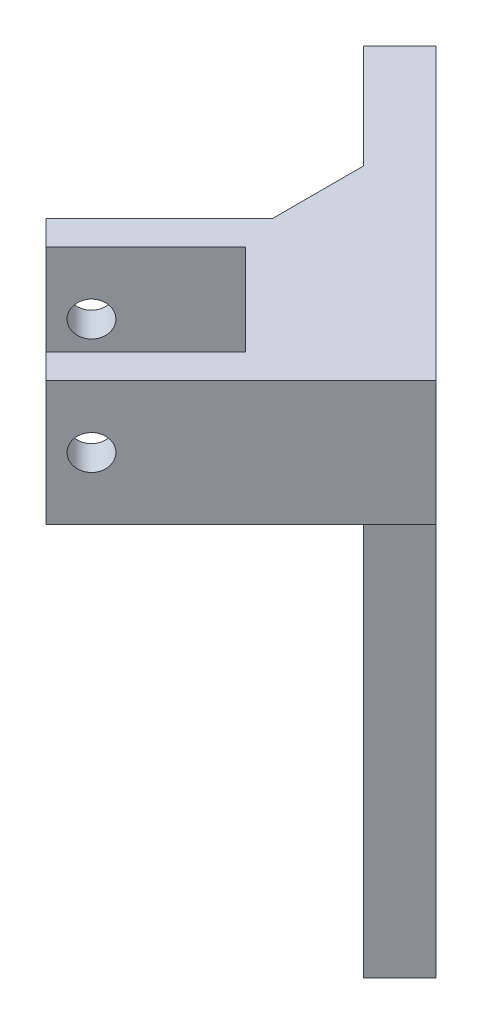
ISO-10303-21;
HEADER;
FILE_DESCRIPTION(('STEP AP214'),'2;1');
FILE_NAME('part.step','',(''),(''),'','','');
FILE_SCHEMA(('AUTOMOTIVE_DESIGN { 1 0 10303 214 1 1 1 1 }'));
ENDSEC;
DATA;
#1=APPLICATION_CONTEXT('core data for automotive mechanical design processes');
#2=APPLICATION_PROTOCOL_DEFINITION('international standard','automotive_design',2000,#1);
#3=PRODUCT_CONTEXT('',#1,'mechanical');
#4=PRODUCT('Part','Part','',(#3));
#5=PRODUCT_RELATED_PRODUCT_CATEGORY('part','',(#4));
#6=PRODUCT_DEFINITION_FORMATION('','',#4);
#7=PRODUCT_DEFINITION_CONTEXT('part definition',#1,'design');
#8=PRODUCT_DEFINITION('design','',#6,#7);
#9=PRODUCT_DEFINITION_SHAPE('','',#8);
#10=(LENGTH_UNIT() NAMED_UNIT(*) SI_UNIT(.MILLI.,.METRE.));
#11=(NAMED_UNIT(*) PLANE_ANGLE_UNIT() SI_UNIT($,.RADIAN.));
#12=(NAMED_UNIT(*) SI_UNIT($,.STERADIAN.) SOLID_ANGLE_UNIT());
#13=UNCERTAINTY_MEASURE_WITH_UNIT(LENGTH_MEASURE(1.E-05),#10,'distance_accuracy_value','');
#14=(GEOMETRIC_REPRESENTATION_CONTEXT(3) GLOBAL_UNCERTAINTY_ASSIGNED_CONTEXT((#13)) GLOBAL_UNIT_ASSIGNED_CONTEXT((#10,
#11,#12)) REPRESENTATION_CONTEXT('',''));
#15=CARTESIAN_POINT('',(0.,0.,0.));
#16=DIRECTION('',(0.,0.,1.));
#17=DIRECTION('',(1.,0.,0.));
#18=AXIS2_PLACEMENT_3D('',#15,#16,#17);
#19=CARTESIAN_POINT('',(5.82842712474632,0.,-5.82842712474632));
#20=DIRECTION('',(0.707106781186547,0.,-0.707106781186547));
#21=DIRECTION('',(-0.707106781186548,0.,-0.707106781186548));
#22=AXIS2_PLACEMENT_3D('',#19,#20,#21);
#23=PLANE('',#22);
#24=DIRECTION('',(0.707106781186547,0.,0.707106781186547));
#25=VECTOR('',#24,1.);
#26=CARTESIAN_POINT('',(10.5578132645612,52.246276120185,-1.09904098493145));
#27=LINE('',#26,#25);
#28=CARTESIAN_POINT('',(28.5960146931866,52.2462761201849,16.9391604436939));
#29=VERTEX_POINT('',#28);
#30=CARTESIAN_POINT('',(32.492080498081,52.2462761201849,20.8352262485884));
#31=VERTEX_POINT('',#30);
#32=EDGE_CURVE('E374',#29,#31,#27,.T.);
#33=ORIENTED_EDGE('',*,*,#32,.F.);
#34=DIRECTION('',(0.,-1.,0.));
#35=VECTOR('',#34,1.);
#36=CARTESIAN_POINT('',(28.5960146931866,0.,16.939160443694));
#37=LINE('',#36,#35);
#38=CARTESIAN_POINT('',(28.5960146931866,32.8244024825225,16.9391604436939));
#39=VERTEX_POINT('',#38);
#40=EDGE_CURVE('E250',#29,#39,#37,.T.);
#41=ORIENTED_EDGE('',*,*,#40,.T.);
#42=DIRECTION('',(-0.707106781186547,0.,-0.707106781186547));
#43=VECTOR('',#42,1.);
#44=CARTESIAN_POINT('',(32.492080498081,32.8244024825225,20.8352262485884));
#45=LINE('',#44,#43);
#46=CARTESIAN_POINT('',(32.492080498081,32.8244024825225,20.8352262485884));
#47=VERTEX_POINT('',#46);
#48=EDGE_CURVE('E489',#47,#39,#45,.T.);
#49=ORIENTED_EDGE('',*,*,#48,.F.);
#50=DIRECTION('',(0.,-1.,0.));
#51=VECTOR('',#50,1.);
#52=CARTESIAN_POINT('',(32.492080498081,52.2462761201849,20.8352262485884));
#53=LINE('',#52,#51);
#54=EDGE_CURVE('E275',#31,#47,#53,.T.);
#55=ORIENTED_EDGE('',*,*,#54,.F.);
#56=EDGE_LOOP('',(#33,#41,#49,#55));
#57=FACE_BOUND('',#56,.T.);
#58=ADVANCED_FACE('F35',(#57),#23,.F.);
#59=CARTESIAN_POINT('',(30.5771644662755,0.,-30.5771644662755));
#60=DIRECTION('',(0.707106781186548,0.,-0.707106781186547));
#61=DIRECTION('',(-0.707106781186547,0.,-0.707106781186548));
#62=AXIS2_PLACEMENT_3D('',#59,#60,#61);
#63=PLANE('',#62);
#64=DIRECTION('',(0.,1.,0.));
#65=VECTOR('',#64,1.);
#66=CARTESIAN_POINT('',(48.0573202068203,32.8244024825225,-13.0970087257306));
#67=LINE('',#66,#65);
#68=CARTESIAN_POINT('',(48.0573202068203,-37.673114458677,-13.0970087257306));
#69=VERTEX_POINT('',#68);
#70=CARTESIAN_POINT('',(48.0573202068203,32.8244024825225,-13.0970087257307));
#71=VERTEX_POINT('',#70);
#72=EDGE_CURVE('E294',#69,#71,#67,.T.);
#73=ORIENTED_EDGE('',*,*,#72,.T.);
#74=DIRECTION('',(-0.707106781186547,0.,-0.707106781186548));
#75=VECTOR('',#74,1.);
#76=CARTESIAN_POINT('',(30.5771644662755,32.8244024825225,-30.5771644662755));
#77=LINE('',#76,#75);
#78=CARTESIAN_POINT('',(39.7606620990654,32.8244024825225,-21.3936668334856));
#79=VERTEX_POINT('',#78);
#80=EDGE_CURVE('E240',#71,#79,#77,.T.);
#81=ORIENTED_EDGE('',*,*,#80,.T.);
#82=DIRECTION('',(0.,-1.,0.));
#83=VECTOR('',#82,1.);
#84=CARTESIAN_POINT('',(39.7606620990653,32.8244024825225,-21.3936668334856));
#85=LINE('',#84,#83);
#86=CARTESIAN_POINT('',(39.7606620990653,-37.673114458677,-21.3936668334856));
#87=VERTEX_POINT('',#86);
#88=EDGE_CURVE('E285',#79,#87,#85,.T.);
#89=ORIENTED_EDGE('',*,*,#88,.T.);
#90=DIRECTION('',(0.707106781186547,0.,0.707106781186548));
#91=VECTOR('',#90,1.);
#92=CARTESIAN_POINT('',(48.0573202068203,-37.673114458677,-13.0970087257306));
#93=LINE('',#92,#91);
#94=EDGE_CURVE('E287',#87,#69,#93,.T.);
#95=ORIENTED_EDGE('',*,*,#94,.T.);
#96=EDGE_LOOP('',(#73,#81,#89,#95));
#97=FACE_BOUND('',#96,.T.);
#98=ADVANCED_FACE('F359',(#97),#63,.F.);
#99=CARTESIAN_POINT('',(48.0573202068203,32.8244024825225,-13.0970087257306));
#100=DIRECTION('',(0.,1.,0.));
#101=DIRECTION('',(0.,0.,1.));
#102=AXIS2_PLACEMENT_3D('',#99,#100,#101);
#103=PLANE('',#102);
#104=DIRECTION('',(0.707106781186548,0.,-0.707106781186547));
#105=VECTOR('',#104,1.);
#106=CARTESIAN_POINT('',(30.5771644662755,32.8244024825225,-30.5771644662755));
#107=LINE('',#106,#105);
#108=CARTESIAN_POINT('',(28.2354827942249,32.8244024825225,-28.2354827942249));
#109=VERTEX_POINT('',#108);
#110=CARTESIAN_POINT('',(36.2340187157679,32.8244024825225,-36.2340187157679));
#111=VERTEX_POINT('',#110);
#112=EDGE_CURVE('E50',#109,#111,#107,.T.);
#113=ORIENTED_EDGE('',*,*,#112,.T.);
#114=DIRECTION('',(0.707106781186548,0.,0.707106781186548));
#115=VECTOR('',#114,1.);
#116=CARTESIAN_POINT('',(53.7141744563127,32.8244024825225,-18.7538629752231));
#117=LINE('',#116,#115);
#118=CARTESIAN_POINT('',(45.4175163485578,32.8244024825225,-27.050521082978));
#119=VERTEX_POINT('',#118);
#120=EDGE_CURVE('E224',#111,#119,#117,.T.);
#121=ORIENTED_EDGE('',*,*,#120,.T.);
#122=DIRECTION('',(0.707106781186548,0.,-0.707106781186547));
#123=VECTOR('',#122,1.);
#124=CARTESIAN_POINT('',(39.7606620990653,32.8244024825225,-21.3936668334856));
#125=LINE('',#124,#123);
#126=EDGE_CURVE('E238',#79,#119,#125,.T.);
#127=ORIENTED_EDGE('',*,*,#126,.F.);
#128=ORIENTED_EDGE('',*,*,#80,.F.);
#129=DIRECTION('',(0.707106781186548,0.,-0.707106781186547));
#130=VECTOR('',#129,1.);
#131=CARTESIAN_POINT('',(48.0573202068203,32.8244024825225,-13.0970087257306));
#132=LINE('',#131,#130);
#133=CARTESIAN_POINT('',(53.7141744563127,32.8244024825225,-18.7538629752231));
#134=VERTEX_POINT('',#133);
#135=EDGE_CURVE('E338',#71,#134,#132,.T.);
#136=ORIENTED_EDGE('',*,*,#135,.T.);
#137=CARTESIAN_POINT('',(62.8976720891026,32.8244024825225,-9.57036534243318));
#138=VERTEX_POINT('',#137);
#139=EDGE_CURVE('E233',#134,#138,#117,.T.);
#140=ORIENTED_EDGE('',*,*,#139,.T.);
#141=DIRECTION('',(0.707106781186548,0.,-0.707106781186547));
#142=VECTOR('',#141,1.);
#143=CARTESIAN_POINT('',(57.2408178396102,32.8244024825225,-3.91351109294075));
#144=LINE('',#143,#142);
#145=EDGE_CURVE('E335',#47,#138,#144,.T.);
#146=ORIENTED_EDGE('',*,*,#145,.F.);
#147=ORIENTED_EDGE('',*,*,#48,.T.);
#148=DIRECTION('',(0.707106781186548,0.,-0.707106781186547));
#149=VECTOR('',#148,1.);
#150=CARTESIAN_POINT('',(53.3447520347157,32.8244024825225,-7.80957689783519));
#151=LINE('',#150,#149);
#152=CARTESIAN_POINT('',(44.1523638792906,32.8244024825225,1.3828112575899));
#153=VERTEX_POINT('',#152);
#154=EDGE_CURVE('E493',#39,#153,#151,.T.);
#155=ORIENTED_EDGE('',*,*,#154,.T.);
#156=DIRECTION('',(-0.707106781186548,0.,-0.707106781186547));
#157=VECTOR('',#156,1.);
#158=CARTESIAN_POINT('',(38.8649320513952,32.8244024825225,-3.90462057030554));
#159=LINE('',#158,#157);
#160=CARTESIAN_POINT('',(30.0102282555597,32.8244024825225,-12.759324366141));
#161=VERTEX_POINT('',#160);
#162=EDGE_CURVE('E490',#153,#161,#159,.T.);
#163=ORIENTED_EDGE('',*,*,#162,.T.);
#164=DIRECTION('',(-0.707106781186547,0.,0.707106781186548));
#165=VECTOR('',#164,1.);
#166=CARTESIAN_POINT('',(39.2026164109848,32.8244024825225,-21.9517125215661));
#167=LINE('',#166,#165);
#168=CARTESIAN_POINT('',(14.4538790694556,32.8244024825225,2.797024819963));
#169=VERTEX_POINT('',#168);
#170=EDGE_CURVE('E504',#161,#169,#167,.T.);
#171=ORIENTED_EDGE('',*,*,#170,.T.);
#172=CARTESIAN_POINT('',(10.5578132645612,32.8244024825225,-1.09904098493145));
#173=VERTEX_POINT('',#172);
#174=EDGE_CURVE('E274',#169,#173,#45,.T.);
#175=ORIENTED_EDGE('',*,*,#174,.T.);
#176=DIRECTION('',(0.707106781186548,0.,-0.707106781186548));
#177=VECTOR('',#176,1.);
#178=CARTESIAN_POINT('',(10.5578132645612,32.8244024825225,-1.09904098493145));
#179=LINE('',#178,#177);
#180=CARTESIAN_POINT('',(28.2354827942249,32.8244024825225,-18.7767105145952));
#181=VERTEX_POINT('',#180);
#182=EDGE_CURVE('E268',#173,#181,#179,.T.);
#183=ORIENTED_EDGE('',*,*,#182,.T.);
#184=DIRECTION('',(0.,0.,-1.));
#185=VECTOR('',#184,1.);
#186=CARTESIAN_POINT('',(28.2354827942249,32.8244024825225,-13.0970087257305));
#187=LINE('',#186,#185);
#188=EDGE_CURVE('E44',#181,#109,#187,.T.);
#189=ORIENTED_EDGE('',*,*,#188,.T.);
#190=EDGE_LOOP('',(#113,#121,#127,#128,#136,#140,#146,#147,#155,#163,#171,#175,#183,#189));
#191=FACE_BOUND('',#190,.T.);
#192=ADVANCED_FACE('F234',(#191),#103,.F.);
#193=CARTESIAN_POINT('',(12.0048651078897,52.2462761201849,-49.1494638246612));
#194=DIRECTION('',(0.,-1.,0.));
#195=DIRECTION('',(0.,0.,-1.));
#196=AXIS2_PLACEMENT_3D('',#193,#194,#195);
#197=PLANE('',#196);
#198=DIRECTION('',(0.707106781186548,0.,-0.707106781186547));
#199=VECTOR('',#198,1.);
#200=CARTESIAN_POINT('',(57.2408178396102,52.2462761201849,-3.91351109294075));
#201=LINE('',#200,#199);
#202=CARTESIAN_POINT('',(62.8976720891026,52.2462761201849,-9.57036534243318));
#203=VERTEX_POINT('',#202);
#204=EDGE_CURVE('E332',#31,#203,#201,.T.);
#205=ORIENTED_EDGE('',*,*,#204,.T.);
#206=DIRECTION('',(-0.707106781186547,0.,-0.707106781186548));
#207=VECTOR('',#206,1.);
#208=CARTESIAN_POINT('',(17.6617193573821,52.2462761201849,-54.8063180741536));
#209=LINE('',#208,#207);
#210=CARTESIAN_POINT('',(17.6617193573821,52.2462761201849,-54.8063180741536));
#211=VERTEX_POINT('',#210);
#212=EDGE_CURVE('E313',#203,#211,#209,.T.);
#213=ORIENTED_EDGE('',*,*,#212,.T.);
#214=DIRECTION('',(0.707106781186548,0.,-0.707106781186547));
#215=VECTOR('',#214,1.);
#216=CARTESIAN_POINT('',(12.0048651078897,52.2462761201849,-49.1494638246612));
#217=LINE('',#216,#215);
#218=CARTESIAN_POINT('',(12.0048651078897,52.2462761201849,-49.1494638246612));
#219=VERTEX_POINT('',#218);
#220=EDGE_CURVE('E329',#219,#211,#217,.T.);
#221=ORIENTED_EDGE('',*,*,#220,.F.);
#222=DIRECTION('',(-0.707106781186547,0.,-0.707106781186548));
#223=VECTOR('',#222,1.);
#224=CARTESIAN_POINT('',(12.0048651078897,52.2462761201849,-49.1494638246612));
#225=LINE('',#224,#223);
#226=CARTESIAN_POINT('',(28.2354827942248,52.2462761201849,-32.9188461383261));
#227=VERTEX_POINT('',#226);
#228=EDGE_CURVE('E297',#227,#219,#225,.T.);
#229=ORIENTED_EDGE('',*,*,#228,.F.);
#230=DIRECTION('',(0.,0.,1.));
#231=VECTOR('',#230,1.);
#232=CARTESIAN_POINT('',(28.2354827942248,52.2462761201849,-49.1494638246613));
#233=LINE('',#232,#231);
#234=CARTESIAN_POINT('',(28.2354827942249,52.246276120185,-18.7767105145952));
#235=VERTEX_POINT('',#234);
#236=EDGE_CURVE('E58',#227,#235,#233,.T.);
#237=ORIENTED_EDGE('',*,*,#236,.T.);
#238=DIRECTION('',(0.707106781186548,0.,-0.707106781186548));
#239=VECTOR('',#238,1.);
#240=CARTESIAN_POINT('',(10.5578132645612,52.246276120185,-1.09904098493145));
#241=LINE('',#240,#239);
#242=CARTESIAN_POINT('',(10.5578132645612,52.246276120185,-1.09904098493145));
#243=VERTEX_POINT('',#242);
#244=EDGE_CURVE('E270',#243,#235,#241,.T.);
#245=ORIENTED_EDGE('',*,*,#244,.F.);
#246=CARTESIAN_POINT('',(14.4538790694556,52.246276120185,2.79702481996299));
#247=VERTEX_POINT('',#246);
#248=EDGE_CURVE('E371',#243,#247,#27,.T.);
#249=ORIENTED_EDGE('',*,*,#248,.T.);
#250=DIRECTION('',(-0.707106781186547,0.,0.707106781186548));
#251=VECTOR('',#250,1.);
#252=CARTESIAN_POINT('',(30.0102282555597,52.2462761201849,-12.7593243661411));
#253=LINE('',#252,#251);
#254=CARTESIAN_POINT('',(30.0102282555597,52.2462761201849,-12.7593243661411));
#255=VERTEX_POINT('',#254);
#256=EDGE_CURVE('E510',#255,#247,#253,.T.);
#257=ORIENTED_EDGE('',*,*,#256,.F.);
#258=DIRECTION('',(-0.707106781186548,0.,-0.707106781186547));
#259=VECTOR('',#258,1.);
#260=CARTESIAN_POINT('',(44.1523638792906,52.2462761201849,1.3828112575899));
#261=LINE('',#260,#259);
#262=CARTESIAN_POINT('',(44.1523638792906,52.2462761201849,1.3828112575899));
#263=VERTEX_POINT('',#262);
#264=EDGE_CURVE('E513',#263,#255,#261,.T.);
#265=ORIENTED_EDGE('',*,*,#264,.F.);
#266=DIRECTION('',(0.707106781186548,0.,-0.707106781186547));
#267=VECTOR('',#266,1.);
#268=CARTESIAN_POINT('',(28.5960146931866,52.2462761201849,16.9391604436939));
#269=LINE('',#268,#267);
#270=EDGE_CURVE('E500',#29,#263,#269,.T.);
#271=ORIENTED_EDGE('',*,*,#270,.F.);
#272=ORIENTED_EDGE('',*,*,#32,.T.);
#273=EDGE_LOOP('',(#205,#213,#221,#229,#237,#245,#249,#257,#265,#271,#272));
#274=FACE_BOUND('',#273,.T.);
#275=ADVANCED_FACE('F497',(#274),#197,.F.);
#276=CARTESIAN_POINT('',(36.2340187157679,0.,-36.2340187157678));
#277=DIRECTION('',(0.707106781186548,0.,-0.707106781186547));
#278=DIRECTION('',(-0.707106781186547,0.,-0.707106781186548));
#279=AXIS2_PLACEMENT_3D('',#276,#277,#278);
#280=PLANE('',#279);
#281=DIRECTION('',(0.,-1.,0.));
#282=VECTOR('',#281,1.);
#283=CARTESIAN_POINT('',(12.4374394279131,0.,-60.0305980036226));
#284=LINE('',#283,#282);
#285=CARTESIAN_POINT('',(12.4374394279131,32.069709817124,-60.0305980036226));
#286=VERTEX_POINT('',#285);
#287=CARTESIAN_POINT('',(12.4374394279131,-47.930290182876,-60.0305980036226));
#288=VERTEX_POINT('',#287);
#289=EDGE_CURVE('E421',#286,#288,#284,.T.);
#290=ORIENTED_EDGE('',*,*,#289,.T.);
#291=CARTESIAN_POINT('',(13.7455869731083,-47.930290182876,-58.7224504584275));
#292=DIRECTION('',(0.707106781186548,0.,-0.707106781186547));
#293=DIRECTION('',(-0.707106781186547,0.,-0.707106781186548));
#294=AXIS2_PLACEMENT_3D('',#291,#292,#293);
#295=CIRCLE('',#294,1.85000000000001);
#296=CARTESIAN_POINT('',(15.0537345183034,-47.930290182876,-57.4143029132324));
#297=VERTEX_POINT('',#296);
#298=EDGE_CURVE('E423',#297,#288,#295,.T.);
#299=ORIENTED_EDGE('',*,*,#298,.F.);
#300=DIRECTION('',(0.,-1.,0.));
#301=VECTOR('',#300,1.);
#302=CARTESIAN_POINT('',(15.0537345183034,0.,-57.4143029132324));
#303=LINE('',#302,#301);
#304=CARTESIAN_POINT('',(15.0537345183033,32.069709817124,-57.4143029132324));
#305=VERTEX_POINT('',#304);
#306=EDGE_CURVE('E426',#305,#297,#303,.T.);
#307=ORIENTED_EDGE('',*,*,#306,.F.);
#308=CARTESIAN_POINT('',(13.7455869731083,32.069709817124,-58.7224504584275));
#309=DIRECTION('',(0.707106781186548,0.,-0.707106781186547));
#310=DIRECTION('',(-0.707106781186547,0.,-0.707106781186548));
#311=AXIS2_PLACEMENT_3D('',#308,#309,#310);
#312=CIRCLE('',#311,1.85);
#313=EDGE_CURVE('E413',#286,#305,#312,.T.);
#314=ORIENTED_EDGE('',*,*,#313,.F.);
#315=EDGE_LOOP('',(#290,#299,#307,#314));
#316=FACE_BOUND('',#315,.T.);
#317=DIRECTION('',(0.,-1.,0.));
#318=VECTOR('',#317,1.);
#319=CARTESIAN_POINT('',(22.1248023301688,0.,-50.3432351013669));
#320=LINE('',#319,#318);
#321=CARTESIAN_POINT('',(22.1248023301688,32.069709817124,-50.3432351013669));
#322=VERTEX_POINT('',#321);
#323=CARTESIAN_POINT('',(22.1248023301688,-47.930290182876,-50.3432351013669));
#324=VERTEX_POINT('',#323);
#325=EDGE_CURVE('E433',#322,#324,#320,.T.);
#326=ORIENTED_EDGE('',*,*,#325,.T.);
#327=CARTESIAN_POINT('',(23.4329498753639,-47.930290182876,-49.0350875561718));
#328=DIRECTION('',(0.707106781186548,0.,-0.707106781186547));
#329=DIRECTION('',(-0.707106781186547,0.,-0.707106781186548));
#330=AXIS2_PLACEMENT_3D('',#327,#328,#329);
#331=CIRCLE('',#330,1.85000000000001);
#332=CARTESIAN_POINT('',(24.7410974205591,-47.930290182876,-47.7269400109767));
#333=VERTEX_POINT('',#332);
#334=EDGE_CURVE('E306',#333,#324,#331,.T.);
#335=ORIENTED_EDGE('',*,*,#334,.F.);
#336=DIRECTION('',(0.,-1.,0.));
#337=VECTOR('',#336,1.);
#338=CARTESIAN_POINT('',(24.7410974205591,0.,-47.7269400109767));
#339=LINE('',#338,#337);
#340=CARTESIAN_POINT('',(24.7410974205591,32.069709817124,-47.7269400109767));
#341=VERTEX_POINT('',#340);
#342=EDGE_CURVE('E428',#341,#333,#339,.T.);
#343=ORIENTED_EDGE('',*,*,#342,.F.);
#344=CARTESIAN_POINT('',(23.4329498753639,32.069709817124,-49.0350875561718));
#345=DIRECTION('',(0.707106781186548,0.,-0.707106781186547));
#346=DIRECTION('',(-0.707106781186547,0.,-0.707106781186548));
#347=AXIS2_PLACEMENT_3D('',#344,#345,#346);
#348=CIRCLE('',#347,1.84999999999999);
#349=EDGE_CURVE('E430',#322,#341,#348,.T.);
#350=ORIENTED_EDGE('',*,*,#349,.F.);
#351=EDGE_LOOP('',(#326,#335,#343,#350));
#352=FACE_BOUND('',#351,.T.);
#353=DIRECTION('',(0.707106781186547,0.,0.707106781186547));
#354=VECTOR('',#353,1.);
#355=CARTESIAN_POINT('',(7.5309128756247,-53.2202506721997,-64.937124555911));
#356=LINE('',#355,#354);
#357=CARTESIAN_POINT('',(7.5309128756247,-53.2202506721997,-64.937124555911));
#358=VERTEX_POINT('',#357);
#359=CARTESIAN_POINT('',(29.6476239728475,-53.2202506721997,-42.8204134586882));
#360=VERTEX_POINT('',#359);
#361=EDGE_CURVE('E289',#358,#360,#356,.T.);
#362=ORIENTED_EDGE('',*,*,#361,.F.);
#363=DIRECTION('',(0.,-1.,0.));
#364=VECTOR('',#363,1.);
#365=CARTESIAN_POINT('',(7.5309128756247,32.8244024825225,-64.937124555911));
#366=LINE('',#365,#364);
#367=CARTESIAN_POINT('',(7.5309128756247,37.9191521959063,-64.937124555911));
#368=VERTEX_POINT('',#367);
#369=EDGE_CURVE('E318',#368,#358,#366,.T.);
#370=ORIENTED_EDGE('',*,*,#369,.F.);
#371=DIRECTION('',(-0.500000000000001,-0.707106781186546,-0.500000000000001));
#372=VECTOR('',#371,1.);
#373=CARTESIAN_POINT('',(7.5309128756247,37.9191521959063,-64.937124555911));
#374=LINE('',#373,#372);
#375=EDGE_CURVE('E315',#211,#368,#374,.T.);
#376=ORIENTED_EDGE('',*,*,#375,.F.);
#377=ORIENTED_EDGE('',*,*,#212,.F.);
#378=DIRECTION('',(0.,1.,0.));
#379=VECTOR('',#378,1.);
#380=CARTESIAN_POINT('',(62.8976720891026,52.2462761201849,-9.57036534243318));
#381=LINE('',#380,#379);
#382=EDGE_CURVE('E231',#138,#203,#381,.T.);
#383=ORIENTED_EDGE('',*,*,#382,.F.);
#384=ORIENTED_EDGE('',*,*,#139,.F.);
#385=DIRECTION('',(0.,1.,0.));
#386=VECTOR('',#385,1.);
#387=CARTESIAN_POINT('',(53.7141744563127,32.8244024825225,-18.753862975223));
#388=LINE('',#387,#386);
#389=CARTESIAN_POINT('',(53.7141744563127,-37.673114458677,-18.753862975223));
#390=VERTEX_POINT('',#389);
#391=EDGE_CURVE('E311',#390,#134,#388,.T.);
#392=ORIENTED_EDGE('',*,*,#391,.F.);
#393=DIRECTION('',(0.707106781186547,0.,0.707106781186548));
#394=VECTOR('',#393,1.);
#395=CARTESIAN_POINT('',(53.7141744563127,-37.673114458677,-18.753862975223));
#396=LINE('',#395,#394);
#397=CARTESIAN_POINT('',(45.4175163485577,-37.673114458677,-27.050521082978));
#398=VERTEX_POINT('',#397);
#399=EDGE_CURVE('E309',#398,#390,#396,.T.);
#400=ORIENTED_EDGE('',*,*,#399,.F.);
#401=DIRECTION('',(0.,-1.,0.));
#402=VECTOR('',#401,1.);
#403=CARTESIAN_POINT('',(45.4175163485577,32.8244024825225,-27.050521082978));
#404=LINE('',#403,#402);
#405=EDGE_CURVE('E220',#119,#398,#404,.T.);
#406=ORIENTED_EDGE('',*,*,#405,.F.);
#407=ORIENTED_EDGE('',*,*,#120,.F.);
#408=DIRECTION('',(0.500000000000001,0.707106781186546,0.500000000000001));
#409=VECTOR('',#408,1.);
#410=CARTESIAN_POINT('',(29.6476239728475,23.5098337099417,-42.8204134586882));
#411=LINE('',#410,#409);
#412=CARTESIAN_POINT('',(29.6476239728475,23.5098337099417,-42.8204134586882));
#413=VERTEX_POINT('',#412);
#414=EDGE_CURVE('E213',#413,#111,#411,.T.);
#415=ORIENTED_EDGE('',*,*,#414,.F.);
#416=DIRECTION('',(0.,1.,0.));
#417=VECTOR('',#416,1.);
#418=CARTESIAN_POINT('',(29.6476239728475,-53.2202506721997,-42.8204134586882));
#419=LINE('',#418,#417);
#420=EDGE_CURVE('E221',#360,#413,#419,.T.);
#421=ORIENTED_EDGE('',*,*,#420,.F.);
#422=EDGE_LOOP('',(#362,#370,#376,#377,#383,#384,#392,#400,#406,#407,#415,#421));
#423=FACE_BOUND('',#422,.T.);
#424=ADVANCED_FACE('F226',(#316,#352,#423),#280,.T.);
#425=CARTESIAN_POINT('',(23.9907697233551,-53.2202506721997,-37.1635592091958));
#426=DIRECTION('',(-0.707106781186547,0.,-0.707106781186548));
#427=DIRECTION('',(-0.707106781186548,0.,0.707106781186547));
#428=AXIS2_PLACEMENT_3D('',#425,#426,#427);
#429=PLANE('',#428);
#430=ORIENTED_EDGE('',*,*,#420,.T.);
#431=DIRECTION('',(0.707106781186548,0.,-0.707106781186547));
#432=VECTOR('',#431,1.);
#433=CARTESIAN_POINT('',(23.9907697233551,23.5098337099417,-37.1635592091958));
#434=LINE('',#433,#432);
#435=CARTESIAN_POINT('',(23.9907697233551,23.5098337099417,-37.1635592091958));
#436=VERTEX_POINT('',#435);
#437=EDGE_CURVE('E217',#436,#413,#434,.T.);
#438=ORIENTED_EDGE('',*,*,#437,.F.);
#439=DIRECTION('',(0.,1.,0.));
#440=VECTOR('',#439,1.);
#441=CARTESIAN_POINT('',(23.9907697233551,-53.2202506721997,-37.1635592091958));
#442=LINE('',#441,#440);
#443=CARTESIAN_POINT('',(23.9907697233551,-53.2202506721997,-37.1635592091958));
#444=VERTEX_POINT('',#443);
#445=EDGE_CURVE('E284',#444,#436,#442,.T.);
#446=ORIENTED_EDGE('',*,*,#445,.F.);
#447=DIRECTION('',(0.707106781186548,0.,-0.707106781186547));
#448=VECTOR('',#447,1.);
#449=CARTESIAN_POINT('',(23.9907697233551,-53.2202506721997,-37.1635592091958));
#450=LINE('',#449,#448);
#451=EDGE_CURVE('E305',#444,#360,#450,.T.);
#452=ORIENTED_EDGE('',*,*,#451,.T.);
#453=EDGE_LOOP('',(#430,#438,#446,#452));
#454=FACE_BOUND('',#453,.T.);
#455=ADVANCED_FACE('F572',(#454),#429,.F.);
#456=CARTESIAN_POINT('',(23.9907697233551,23.5098337099417,-37.1635592091958));
#457=DIRECTION('',(-0.499999999999999,0.707106781186549,-0.499999999999999));
#458=DIRECTION('',(0.,0.577350269189624,0.816496580927727));
#459=AXIS2_PLACEMENT_3D('',#456,#457,#458);
#460=PLANE('',#459);
#461=ORIENTED_EDGE('',*,*,#414,.T.);
#462=ORIENTED_EDGE('',*,*,#112,.F.);
#463=DIRECTION('',(0.,-0.577350269189626,-0.816496580927726));
#464=VECTOR('',#463,1.);
#465=CARTESIAN_POINT('',(28.2354827942248,25.5108106410104,-38.5784635661524));
#466=LINE('',#465,#464);
#467=CARTESIAN_POINT('',(28.2354827942248,29.512764503148,-32.9188461383261));
#468=VERTEX_POINT('',#467);
#469=EDGE_CURVE('E11',#109,#468,#466,.T.);
#470=ORIENTED_EDGE('',*,*,#469,.T.);
#471=DIRECTION('',(0.500000000000001,0.707106781186546,0.500000000000001));
#472=VECTOR('',#471,1.);
#473=CARTESIAN_POINT('',(23.9907697233551,23.5098337099417,-37.1635592091958));
#474=LINE('',#473,#472);
#475=EDGE_CURVE('E279',#436,#468,#474,.T.);
#476=ORIENTED_EDGE('',*,*,#475,.F.);
#477=ORIENTED_EDGE('',*,*,#437,.T.);
#478=EDGE_LOOP('',(#461,#462,#470,#476,#477));
#479=FACE_BOUND('',#478,.T.);
#480=ADVANCED_FACE('F215',(#479),#460,.F.);
#481=CARTESIAN_POINT('',(39.7606620990653,32.8244024825225,-21.3936668334856));
#482=DIRECTION('',(0.707106781186547,0.,0.707106781186548));
#483=DIRECTION('',(0.707106781186548,0.,-0.707106781186547));
#484=AXIS2_PLACEMENT_3D('',#481,#482,#483);
#485=PLANE('',#484);
#486=ORIENTED_EDGE('',*,*,#405,.T.);
#487=DIRECTION('',(0.707106781186548,0.,-0.707106781186547));
#488=VECTOR('',#487,1.);
#489=CARTESIAN_POINT('',(39.7606620990653,-37.673114458677,-21.3936668334856));
#490=LINE('',#489,#488);
#491=EDGE_CURVE('E242',#87,#398,#490,.T.);
#492=ORIENTED_EDGE('',*,*,#491,.F.);
#493=ORIENTED_EDGE('',*,*,#88,.F.);
#494=ORIENTED_EDGE('',*,*,#126,.T.);
#495=EDGE_LOOP('',(#486,#492,#493,#494));
#496=FACE_BOUND('',#495,.T.);
#497=ADVANCED_FACE('F360',(#496),#485,.F.);
#498=CARTESIAN_POINT('',(48.0573202068203,-37.673114458677,-13.0970087257306));
#499=DIRECTION('',(0.,1.,0.));
#500=DIRECTION('',(0.,0.,1.));
#501=AXIS2_PLACEMENT_3D('',#498,#499,#500);
#502=PLANE('',#501);
#503=ORIENTED_EDGE('',*,*,#399,.T.);
#504=DIRECTION('',(0.707106781186548,0.,-0.707106781186547));
#505=VECTOR('',#504,1.);
#506=CARTESIAN_POINT('',(48.0573202068203,-37.673114458677,-13.0970087257306));
#507=LINE('',#506,#505);
#508=EDGE_CURVE('E341',#69,#390,#507,.T.);
#509=ORIENTED_EDGE('',*,*,#508,.F.);
#510=ORIENTED_EDGE('',*,*,#94,.F.);
#511=ORIENTED_EDGE('',*,*,#491,.T.);
#512=EDGE_LOOP('',(#503,#509,#510,#511));
#513=FACE_BOUND('',#512,.T.);
#514=ADVANCED_FACE('F347',(#513),#502,.F.);
#515=CARTESIAN_POINT('',(48.0573202068203,32.8244024825225,-13.0970087257306));
#516=DIRECTION('',(-0.707106781186547,0.,-0.707106781186548));
#517=DIRECTION('',(-0.707106781186548,0.,0.707106781186547));
#518=AXIS2_PLACEMENT_3D('',#515,#516,#517);
#519=PLANE('',#518);
#520=ORIENTED_EDGE('',*,*,#391,.T.);
#521=ORIENTED_EDGE('',*,*,#135,.F.);
#522=ORIENTED_EDGE('',*,*,#72,.F.);
#523=ORIENTED_EDGE('',*,*,#508,.T.);
#524=EDGE_LOOP('',(#520,#521,#522,#523));
#525=FACE_BOUND('',#524,.T.);
#526=ADVANCED_FACE('F356',(#525),#519,.F.);
#527=CARTESIAN_POINT('',(57.2408178396102,52.2462761201849,-3.91351109294075));
#528=DIRECTION('',(-0.707106781186547,0.,-0.707106781186548));
#529=DIRECTION('',(-0.707106781186548,0.,0.707106781186547));
#530=AXIS2_PLACEMENT_3D('',#527,#528,#529);
#531=PLANE('',#530);
#532=CARTESIAN_POINT('',(36.0276144040138,42.5353393013537,17.2996923426556));
#533=DIRECTION('',(-0.707106781186547,0.,-0.707106781186548));
#534=DIRECTION('',(-0.707106781186548,0.,0.707106781186547));
#535=AXIS2_PLACEMENT_3D('',#532,#533,#534);
#536=CIRCLE('',#535,2.7);
#537=CARTESIAN_POINT('',(34.1184260948101,42.5353393013537,19.2088806518593));
#538=VERTEX_POINT('',#537);
#539=EDGE_CURVE('E517',#538,#538,#536,.T.);
#540=ORIENTED_EDGE('',*,*,#539,.T.);
#541=EDGE_LOOP('',(#540));
#542=FACE_BOUND('',#541,.T.);
#543=ORIENTED_EDGE('',*,*,#145,.T.);
#544=ORIENTED_EDGE('',*,*,#382,.T.);
#545=ORIENTED_EDGE('',*,*,#204,.F.);
#546=ORIENTED_EDGE('',*,*,#54,.T.);
#547=EDGE_LOOP('',(#543,#544,#545,#546));
#548=FACE_BOUND('',#547,.T.);
#549=ADVANCED_FACE('F366',(#542,#548),#531,.F.);
#550=CARTESIAN_POINT('',(1.87405862613232,37.9191521959063,-59.2802703064186));
#551=DIRECTION('',(0.499999999999999,-0.707106781186549,0.499999999999999));
#552=DIRECTION('',(0.,-0.577350269189625,-0.816496580927727));
#553=AXIS2_PLACEMENT_3D('',#550,#551,#552);
#554=PLANE('',#553);
#555=ORIENTED_EDGE('',*,*,#375,.T.);
#556=DIRECTION('',(0.707106781186548,0.,-0.707106781186547));
#557=VECTOR('',#556,1.);
#558=CARTESIAN_POINT('',(1.87405862613232,37.9191521959063,-59.2802703064186));
#559=LINE('',#558,#557);
#560=CARTESIAN_POINT('',(1.87405862613232,37.9191521959063,-59.2802703064186));
#561=VERTEX_POINT('',#560);
#562=EDGE_CURVE('E326',#561,#368,#559,.T.);
#563=ORIENTED_EDGE('',*,*,#562,.F.);
#564=DIRECTION('',(-0.500000000000001,-0.707106781186546,-0.500000000000001));
#565=VECTOR('',#564,1.);
#566=CARTESIAN_POINT('',(1.87405862613232,37.9191521959063,-59.2802703064186));
#567=LINE('',#566,#565);
#568=EDGE_CURVE('E299',#219,#561,#567,.T.);
#569=ORIENTED_EDGE('',*,*,#568,.F.);
#570=ORIENTED_EDGE('',*,*,#220,.T.);
#571=EDGE_LOOP('',(#555,#563,#569,#570));
#572=FACE_BOUND('',#571,.T.);
#573=ADVANCED_FACE('F553',(#572),#554,.F.);
#574=CARTESIAN_POINT('',(1.87405862613232,32.8244024825225,-59.2802703064186));
#575=DIRECTION('',(0.707106781186547,0.,0.707106781186548));
#576=DIRECTION('',(0.707106781186548,0.,-0.707106781186547));
#577=AXIS2_PLACEMENT_3D('',#574,#575,#576);
#578=PLANE('',#577);
#579=ORIENTED_EDGE('',*,*,#369,.T.);
#580=DIRECTION('',(0.707106781186548,0.,-0.707106781186547));
#581=VECTOR('',#580,1.);
#582=CARTESIAN_POINT('',(1.87405862613232,-53.2202506721997,-59.2802703064186));
#583=LINE('',#582,#581);
#584=CARTESIAN_POINT('',(1.87405862613232,-53.2202506721997,-59.2802703064186));
#585=VERTEX_POINT('',#584);
#586=EDGE_CURVE('E323',#585,#358,#583,.T.);
#587=ORIENTED_EDGE('',*,*,#586,.F.);
#588=DIRECTION('',(0.,-1.,0.));
#589=VECTOR('',#588,1.);
#590=CARTESIAN_POINT('',(1.87405862613232,32.8244024825225,-59.2802703064186));
#591=LINE('',#590,#589);
#592=EDGE_CURVE('E301',#561,#585,#591,.T.);
#593=ORIENTED_EDGE('',*,*,#592,.F.);
#594=ORIENTED_EDGE('',*,*,#562,.T.);
#595=EDGE_LOOP('',(#579,#587,#593,#594));
#596=FACE_BOUND('',#595,.T.);
#597=ADVANCED_FACE('F559',(#596),#578,.F.);
#598=CARTESIAN_POINT('',(1.87405862613232,-53.2202506721997,-59.2802703064186));
#599=DIRECTION('',(0.,1.,0.));
#600=DIRECTION('',(0.,0.,1.));
#601=AXIS2_PLACEMENT_3D('',#598,#599,#600);
#602=PLANE('',#601);
#603=ORIENTED_EDGE('',*,*,#361,.T.);
#604=ORIENTED_EDGE('',*,*,#451,.F.);
#605=DIRECTION('',(0.707106781186547,0.,0.707106781186547));
#606=VECTOR('',#605,1.);
#607=CARTESIAN_POINT('',(1.87405862613232,-53.2202506721997,-59.2802703064186));
#608=LINE('',#607,#606);
#609=EDGE_CURVE('E303',#585,#444,#608,.T.);
#610=ORIENTED_EDGE('',*,*,#609,.F.);
#611=ORIENTED_EDGE('',*,*,#586,.T.);
#612=EDGE_LOOP('',(#603,#604,#610,#611));
#613=FACE_BOUND('',#612,.T.);
#614=ADVANCED_FACE('F584',(#613),#602,.F.);
#615=DIRECTION('',(0.,1.,0.));
#616=VECTOR('',#615,1.);
#617=CARTESIAN_POINT('',(19.0842431710667,-47.930290182876,-42.0700857614843));
#618=LINE('',#617,#616);
#619=CARTESIAN_POINT('',(19.0842431710667,-47.930290182876,-42.0700857614843));
#620=VERTEX_POINT('',#619);
#621=CARTESIAN_POINT('',(19.0842431710667,32.069709817124,-42.0700857614843));
#622=VERTEX_POINT('',#621);
#623=EDGE_CURVE('E394',#620,#622,#618,.T.);
#624=ORIENTED_EDGE('',*,*,#623,.F.);
#625=CARTESIAN_POINT('',(17.7760956258716,-47.930290182876,-43.3782333066794));
#626=DIRECTION('',(-0.707106781186548,0.,0.707106781186547));
#627=DIRECTION('',(0.707106781186547,0.,0.707106781186548));
#628=AXIS2_PLACEMENT_3D('',#625,#626,#627);
#629=CIRCLE('',#628,1.85000000000001);
#630=CARTESIAN_POINT('',(16.4679480806764,-47.930290182876,-44.6863808518745));
#631=VERTEX_POINT('',#630);
#632=EDGE_CURVE('E397',#631,#620,#629,.T.);
#633=ORIENTED_EDGE('',*,*,#632,.F.);
#634=DIRECTION('',(0.,1.,0.));
#635=VECTOR('',#634,1.);
#636=CARTESIAN_POINT('',(16.4679480806764,-47.930290182876,-44.6863808518745));
#637=LINE('',#636,#635);
#638=CARTESIAN_POINT('',(16.4679480806765,32.069709817124,-44.6863808518745));
#639=VERTEX_POINT('',#638);
#640=EDGE_CURVE('E383',#631,#639,#637,.T.);
#641=ORIENTED_EDGE('',*,*,#640,.T.);
#642=CARTESIAN_POINT('',(17.7760956258716,32.069709817124,-43.3782333066794));
#643=DIRECTION('',(-0.707106781186548,0.,0.707106781186547));
#644=DIRECTION('',(0.707106781186547,0.,0.707106781186548));
#645=AXIS2_PLACEMENT_3D('',#642,#643,#644);
#646=CIRCLE('',#645,1.84999999999999);
#647=EDGE_CURVE('E391',#622,#639,#646,.T.);
#648=ORIENTED_EDGE('',*,*,#647,.F.);
#649=EDGE_LOOP('',(#624,#633,#641,#648));
#650=FACE_BOUND('',#649,.T.);
#651=CARTESIAN_POINT('',(8.08873272361588,32.069709817124,-53.0655962089351));
#652=DIRECTION('',(-0.707106781186548,0.,0.707106781186547));
#653=DIRECTION('',(0.707106781186547,0.,0.707106781186548));
#654=AXIS2_PLACEMENT_3D('',#651,#652,#653);
#655=CIRCLE('',#654,1.85);
#656=CARTESIAN_POINT('',(9.39688026881098,32.069709817124,-51.75744866374));
#657=VERTEX_POINT('',#656);
#658=CARTESIAN_POINT('',(6.78058517842076,32.069709817124,-54.3737437541302));
#659=VERTEX_POINT('',#658);
#660=EDGE_CURVE('E401',#657,#659,#655,.T.);
#661=ORIENTED_EDGE('',*,*,#660,.F.);
#662=DIRECTION('',(0.,1.,0.));
#663=VECTOR('',#662,1.);
#664=CARTESIAN_POINT('',(9.39688026881098,0.,-51.75744866374));
#665=LINE('',#664,#663);
#666=CARTESIAN_POINT('',(9.39688026881099,-47.930290182876,-51.75744866374));
#667=VERTEX_POINT('',#666);
#668=EDGE_CURVE('E399',#667,#657,#665,.T.);
#669=ORIENTED_EDGE('',*,*,#668,.F.);
#670=CARTESIAN_POINT('',(8.08873272361588,-47.930290182876,-53.0655962089351));
#671=DIRECTION('',(-0.707106781186548,0.,0.707106781186547));
#672=DIRECTION('',(0.707106781186547,0.,0.707106781186548));
#673=AXIS2_PLACEMENT_3D('',#670,#671,#672);
#674=CIRCLE('',#673,1.85000000000001);
#675=CARTESIAN_POINT('',(6.78058517842075,-47.930290182876,-54.3737437541302));
#676=VERTEX_POINT('',#675);
#677=EDGE_CURVE('E407',#676,#667,#674,.T.);
#678=ORIENTED_EDGE('',*,*,#677,.F.);
#679=DIRECTION('',(0.,1.,0.));
#680=VECTOR('',#679,1.);
#681=CARTESIAN_POINT('',(6.78058517842076,0.,-54.3737437541302));
#682=LINE('',#681,#680);
#683=EDGE_CURVE('E404',#676,#659,#682,.T.);
#684=ORIENTED_EDGE('',*,*,#683,.T.);
#685=EDGE_LOOP('',(#661,#669,#678,#684));
#686=FACE_BOUND('',#685,.T.);
#687=ORIENTED_EDGE('',*,*,#475,.T.);
#688=DIRECTION('',(0.,1.,0.));
#689=VECTOR('',#688,1.);
#690=CARTESIAN_POINT('',(28.2354827942248,0.,-32.9188461383261));
#691=LINE('',#690,#689);
#692=EDGE_CURVE('E253',#468,#227,#691,.T.);
#693=ORIENTED_EDGE('',*,*,#692,.T.);
#694=ORIENTED_EDGE('',*,*,#228,.T.);
#695=ORIENTED_EDGE('',*,*,#568,.T.);
#696=ORIENTED_EDGE('',*,*,#592,.T.);
#697=ORIENTED_EDGE('',*,*,#609,.T.);
#698=ORIENTED_EDGE('',*,*,#445,.T.);
#699=EDGE_LOOP('',(#687,#693,#694,#695,#696,#697,#698));
#700=FACE_BOUND('',#699,.T.);
#701=ADVANCED_FACE('F282',(#650,#686,#700),#63,.F.);
#702=CARTESIAN_POINT('',(41.2166854222056,0.,-83.5772538171346));
#703=DIRECTION('',(0.707106781186547,0.,0.707106781186547));
#704=DIRECTION('',(0.707106781186548,0.,-0.707106781186547));
#705=AXIS2_PLACEMENT_3D('',#702,#703,#704);
#706=PLANE('',#705);
#707=ORIENTED_EDGE('',*,*,#306,.T.);
#708=DIRECTION('',(-0.707106781186547,0.,0.707106781186547));
#709=VECTOR('',#708,1.);
#710=CARTESIAN_POINT('',(41.2166854222056,-47.930290182876,-83.5772538171346));
#711=LINE('',#710,#709);
#712=EDGE_CURVE('E411',#297,#667,#711,.T.);
#713=ORIENTED_EDGE('',*,*,#712,.T.);
#714=ORIENTED_EDGE('',*,*,#668,.T.);
#715=DIRECTION('',(-0.707106781186547,0.,0.707106781186547));
#716=VECTOR('',#715,1.);
#717=CARTESIAN_POINT('',(41.2166854222056,32.069709817124,-83.5772538171347));
#718=LINE('',#717,#716);
#719=EDGE_CURVE('E410',#305,#657,#718,.T.);
#720=ORIENTED_EDGE('',*,*,#719,.F.);
#721=EDGE_LOOP('',(#707,#713,#714,#720));
#722=FACE_BOUND('',#721,.T.);
#723=ADVANCED_FACE('F601',(#722),#706,.F.);
#724=CARTESIAN_POINT('',(39.9085378770105,-47.930290182876,-84.8854013623297));
#725=DIRECTION('',(-0.707106781186547,0.,0.707106781186547));
#726=DIRECTION('',(0.707106781186547,0.,0.707106781186548));
#727=AXIS2_PLACEMENT_3D('',#724,#725,#726);
#728=CYLINDRICAL_SURFACE('',#727,1.85000000000001);
#729=ORIENTED_EDGE('',*,*,#298,.T.);
#730=DIRECTION('',(-0.707106781186547,0.,0.707106781186547));
#731=VECTOR('',#730,1.);
#732=CARTESIAN_POINT('',(38.6003903318154,-47.930290182876,-86.1935489075249));
#733=LINE('',#732,#731);
#734=EDGE_CURVE('E414',#288,#676,#733,.T.);
#735=ORIENTED_EDGE('',*,*,#734,.T.);
#736=ORIENTED_EDGE('',*,*,#677,.T.);
#737=ORIENTED_EDGE('',*,*,#712,.F.);
#738=EDGE_LOOP('',(#729,#735,#736,#737));
#739=FACE_BOUND('',#738,.T.);
#740=ADVANCED_FACE('F604',(#739),#728,.F.);
#741=CARTESIAN_POINT('',(38.6003903318154,0.,-86.1935489075249));
#742=DIRECTION('',(0.707106781186547,0.,0.707106781186547));
#743=DIRECTION('',(0.707106781186548,0.,-0.707106781186547));
#744=AXIS2_PLACEMENT_3D('',#741,#742,#743);
#745=PLANE('',#744);
#746=DIRECTION('',(-0.707106781186547,0.,0.707106781186547));
#747=VECTOR('',#746,1.);
#748=CARTESIAN_POINT('',(38.6003903318154,32.069709817124,-86.1935489075249));
#749=LINE('',#748,#747);
#750=EDGE_CURVE('E416',#286,#659,#749,.T.);
#751=ORIENTED_EDGE('',*,*,#750,.T.);
#752=ORIENTED_EDGE('',*,*,#683,.F.);
#753=ORIENTED_EDGE('',*,*,#734,.F.);
#754=ORIENTED_EDGE('',*,*,#289,.F.);
#755=EDGE_LOOP('',(#751,#752,#753,#754));
#756=FACE_BOUND('',#755,.T.);
#757=ADVANCED_FACE('F609',(#756),#745,.T.);
#758=CARTESIAN_POINT('',(39.9085378770105,32.069709817124,-84.8854013623297));
#759=DIRECTION('',(-0.707106781186547,0.,0.707106781186547));
#760=DIRECTION('',(0.707106781186547,0.,0.707106781186548));
#761=AXIS2_PLACEMENT_3D('',#758,#759,#760);
#762=CYLINDRICAL_SURFACE('',#761,1.85);
#763=ORIENTED_EDGE('',*,*,#313,.T.);
#764=ORIENTED_EDGE('',*,*,#719,.T.);
#765=ORIENTED_EDGE('',*,*,#660,.T.);
#766=ORIENTED_EDGE('',*,*,#750,.F.);
#767=EDGE_LOOP('',(#763,#764,#765,#766));
#768=FACE_BOUND('',#767,.T.);
#769=ADVANCED_FACE('F606',(#768),#762,.F.);
#770=CARTESIAN_POINT('',(49.5959007792662,-47.930290182876,-75.198038460074));
#771=DIRECTION('',(-0.707106781186547,0.,0.707106781186547));
#772=DIRECTION('',(0.707106781186547,0.,0.707106781186548));
#773=AXIS2_PLACEMENT_3D('',#770,#771,#772);
#774=CYLINDRICAL_SURFACE('',#773,1.85000000000001);
#775=ORIENTED_EDGE('',*,*,#334,.T.);
#776=DIRECTION('',(-0.707106781186547,0.,0.707106781186547));
#777=VECTOR('',#776,1.);
#778=CARTESIAN_POINT('',(48.2877532340711,-47.930290182876,-76.5061860052692));
#779=LINE('',#778,#777);
#780=EDGE_CURVE('E378',#324,#631,#779,.T.);
#781=ORIENTED_EDGE('',*,*,#780,.T.);
#782=ORIENTED_EDGE('',*,*,#632,.T.);
#783=DIRECTION('',(-0.707106781186547,0.,0.707106781186547));
#784=VECTOR('',#783,1.);
#785=CARTESIAN_POINT('',(50.9040483244613,-47.930290182876,-73.8898909148789));
#786=LINE('',#785,#784);
#787=EDGE_CURVE('E380',#333,#620,#786,.T.);
#788=ORIENTED_EDGE('',*,*,#787,.F.);
#789=EDGE_LOOP('',(#775,#781,#782,#788));
#790=FACE_BOUND('',#789,.T.);
#791=ADVANCED_FACE('F439',(#790),#774,.F.);
#792=CARTESIAN_POINT('',(48.2877532340711,-47.930290182876,-76.5061860052692));
#793=DIRECTION('',(0.707106781186547,0.,0.707106781186547));
#794=DIRECTION('',(0.707106781186548,0.,-0.707106781186547));
#795=AXIS2_PLACEMENT_3D('',#792,#793,#794);
#796=PLANE('',#795);
#797=DIRECTION('',(-0.707106781186547,0.,0.707106781186547));
#798=VECTOR('',#797,1.);
#799=CARTESIAN_POINT('',(48.2877532340711,32.069709817124,-76.5061860052691));
#800=LINE('',#799,#798);
#801=EDGE_CURVE('E386',#322,#639,#800,.T.);
#802=ORIENTED_EDGE('',*,*,#801,.T.);
#803=ORIENTED_EDGE('',*,*,#640,.F.);
#804=ORIENTED_EDGE('',*,*,#780,.F.);
#805=ORIENTED_EDGE('',*,*,#325,.F.);
#806=EDGE_LOOP('',(#802,#803,#804,#805));
#807=FACE_BOUND('',#806,.T.);
#808=ADVANCED_FACE('F444',(#807),#796,.T.);
#809=CARTESIAN_POINT('',(49.5959007792662,32.069709817124,-75.198038460074));
#810=DIRECTION('',(-0.707106781186547,0.,0.707106781186547));
#811=DIRECTION('',(0.707106781186547,0.,0.707106781186548));
#812=AXIS2_PLACEMENT_3D('',#809,#810,#811);
#813=CYLINDRICAL_SURFACE('',#812,1.84999999999999);
#814=ORIENTED_EDGE('',*,*,#349,.T.);
#815=DIRECTION('',(-0.707106781186547,0.,0.707106781186547));
#816=VECTOR('',#815,1.);
#817=CARTESIAN_POINT('',(50.9040483244613,32.069709817124,-73.8898909148789));
#818=LINE('',#817,#816);
#819=EDGE_CURVE('E384',#341,#622,#818,.T.);
#820=ORIENTED_EDGE('',*,*,#819,.T.);
#821=ORIENTED_EDGE('',*,*,#647,.T.);
#822=ORIENTED_EDGE('',*,*,#801,.F.);
#823=EDGE_LOOP('',(#814,#820,#821,#822));
#824=FACE_BOUND('',#823,.T.);
#825=ADVANCED_FACE('F455',(#824),#813,.F.);
#826=CARTESIAN_POINT('',(50.9040483244613,-47.930290182876,-73.8898909148789));
#827=DIRECTION('',(0.707106781186547,0.,0.707106781186547));
#828=DIRECTION('',(0.707106781186548,0.,-0.707106781186547));
#829=AXIS2_PLACEMENT_3D('',#826,#827,#828);
#830=PLANE('',#829);
#831=ORIENTED_EDGE('',*,*,#342,.T.);
#832=ORIENTED_EDGE('',*,*,#787,.T.);
#833=ORIENTED_EDGE('',*,*,#623,.T.);
#834=ORIENTED_EDGE('',*,*,#819,.F.);
#835=EDGE_LOOP('',(#831,#832,#833,#834));
#836=FACE_BOUND('',#835,.T.);
#837=ADVANCED_FACE('F452',(#836),#830,.F.);
#838=CARTESIAN_POINT('',(10.5578132645612,32.8244024825225,-1.09904098493145));
#839=DIRECTION('',(-0.707106781186548,0.,-0.707106781186548));
#840=DIRECTION('',(-0.707106781186548,0.,0.707106781186548));
#841=AXIS2_PLACEMENT_3D('',#838,#839,#840);
#842=PLANE('',#841);
#843=CARTESIAN_POINT('',(14.0933471704939,42.5353393013537,-4.63457489086419));
#844=DIRECTION('',(-0.707106781186548,0.,-0.707106781186547));
#845=DIRECTION('',(-0.707106781186547,0.,0.707106781186548));
#846=AXIS2_PLACEMENT_3D('',#843,#844,#845);
#847=CIRCLE('',#846,2.7);
#848=CARTESIAN_POINT('',(12.1841588612902,42.5353393013537,-2.72538658166051));
#849=VERTEX_POINT('',#848);
#850=EDGE_CURVE('E258',#849,#849,#847,.T.);
#851=ORIENTED_EDGE('',*,*,#850,.F.);
#852=EDGE_LOOP('',(#851));
#853=FACE_BOUND('',#852,.T.);
#854=ORIENTED_EDGE('',*,*,#244,.T.);
#855=DIRECTION('',(0.,-1.,0.));
#856=VECTOR('',#855,1.);
#857=CARTESIAN_POINT('',(28.2354827942249,32.8244024825225,-18.7767105145952));
#858=LINE('',#857,#856);
#859=EDGE_CURVE('E261',#235,#181,#858,.T.);
#860=ORIENTED_EDGE('',*,*,#859,.T.);
#861=ORIENTED_EDGE('',*,*,#182,.F.);
#862=DIRECTION('',(0.,1.,0.));
#863=VECTOR('',#862,1.);
#864=CARTESIAN_POINT('',(10.5578132645612,32.8244024825225,-1.09904098493145));
#865=LINE('',#864,#863);
#866=EDGE_CURVE('E488',#173,#243,#865,.T.);
#867=ORIENTED_EDGE('',*,*,#866,.T.);
#868=EDGE_LOOP('',(#854,#860,#861,#867));
#869=FACE_BOUND('',#868,.T.);
#870=ADVANCED_FACE('F266',(#853,#869),#842,.T.);
#871=ORIENTED_EDGE('',*,*,#174,.F.);
#872=DIRECTION('',(0.,1.,0.));
#873=VECTOR('',#872,1.);
#874=CARTESIAN_POINT('',(14.4538790694556,0.,2.79702481996301));
#875=LINE('',#874,#873);
#876=EDGE_CURVE('E247',#169,#247,#875,.T.);
#877=ORIENTED_EDGE('',*,*,#876,.T.);
#878=ORIENTED_EDGE('',*,*,#248,.F.);
#879=ORIENTED_EDGE('',*,*,#866,.F.);
#880=EDGE_LOOP('',(#871,#877,#878,#879));
#881=FACE_BOUND('',#880,.T.);
#882=ADVANCED_FACE('F467',(#881),#23,.F.);
#883=CARTESIAN_POINT('',(44.1523638792906,27.2462761201849,1.3828112575899));
#884=DIRECTION('',(0.707106781186547,0.,-0.707106781186548));
#885=DIRECTION('',(-0.707106781186548,0.,-0.707106781186547));
#886=AXIS2_PLACEMENT_3D('',#883,#884,#885);
#887=PLANE('',#886);
#888=DIRECTION('',(0.,1.,0.));
#889=VECTOR('',#888,1.);
#890=CARTESIAN_POINT('',(44.1523638792906,27.2462761201849,1.3828112575899));
#891=LINE('',#890,#889);
#892=EDGE_CURVE('E508',#153,#263,#891,.T.);
#893=ORIENTED_EDGE('',*,*,#892,.T.);
#894=ORIENTED_EDGE('',*,*,#264,.T.);
#895=DIRECTION('',(0.,1.,0.));
#896=VECTOR('',#895,1.);
#897=CARTESIAN_POINT('',(30.0102282555597,27.2462761201849,-12.759324366141));
#898=LINE('',#897,#896);
#899=EDGE_CURVE('E505',#161,#255,#898,.T.);
#900=ORIENTED_EDGE('',*,*,#899,.F.);
#901=ORIENTED_EDGE('',*,*,#162,.F.);
#902=EDGE_LOOP('',(#893,#894,#900,#901));
#903=FACE_BOUND('',#902,.T.);
#904=ADVANCED_FACE('F477',(#903),#887,.F.);
#905=CARTESIAN_POINT('',(28.5960146931866,27.2462761201849,16.9391604436939));
#906=DIRECTION('',(0.707106781186547,0.,0.707106781186548));
#907=DIRECTION('',(0.707106781186548,0.,-0.707106781186547));
#908=AXIS2_PLACEMENT_3D('',#905,#906,#907);
#909=PLANE('',#908);
#910=CARTESIAN_POINT('',(32.1315485991193,42.5353393013537,13.4036265377612));
#911=DIRECTION('',(0.707106781186547,0.,0.707106781186548));
#912=DIRECTION('',(0.707106781186548,0.,-0.707106781186547));
#913=AXIS2_PLACEMENT_3D('',#910,#911,#912);
#914=CIRCLE('',#913,2.7);
#915=CARTESIAN_POINT('',(34.040736908323,42.5353393013537,11.4944382285575));
#916=VERTEX_POINT('',#915);
#917=EDGE_CURVE('E257',#916,#916,#914,.T.);
#918=ORIENTED_EDGE('',*,*,#917,.T.);
#919=EDGE_LOOP('',(#918));
#920=FACE_BOUND('',#919,.T.);
#921=ORIENTED_EDGE('',*,*,#40,.F.);
#922=ORIENTED_EDGE('',*,*,#270,.T.);
#923=ORIENTED_EDGE('',*,*,#892,.F.);
#924=ORIENTED_EDGE('',*,*,#154,.F.);
#925=EDGE_LOOP('',(#921,#922,#923,#924));
#926=FACE_BOUND('',#925,.T.);
#927=ADVANCED_FACE('F483',(#920,#926),#909,.F.);
#928=CARTESIAN_POINT('',(30.0102282555597,27.2462761201849,-12.759324366141));
#929=DIRECTION('',(-0.707106781186548,0.,-0.707106781186547));
#930=DIRECTION('',(-0.707106781186547,0.,0.707106781186548));
#931=AXIS2_PLACEMENT_3D('',#928,#929,#930);
#932=PLANE('',#931);
#933=CARTESIAN_POINT('',(17.9894129753884,42.5353393013537,-0.738509085969744));
#934=DIRECTION('',(-0.707106781186548,0.,-0.707106781186547));
#935=DIRECTION('',(-0.707106781186547,0.,0.707106781186548));
#936=AXIS2_PLACEMENT_3D('',#933,#934,#935);
#937=CIRCLE('',#936,2.7);
#938=CARTESIAN_POINT('',(16.0802246661847,42.5353393013537,1.17067922323394));
#939=VERTEX_POINT('',#938);
#940=EDGE_CURVE('E254',#939,#939,#937,.T.);
#941=ORIENTED_EDGE('',*,*,#940,.T.);
#942=EDGE_LOOP('',(#941));
#943=FACE_BOUND('',#942,.T.);
#944=ORIENTED_EDGE('',*,*,#899,.T.);
#945=ORIENTED_EDGE('',*,*,#256,.T.);
#946=ORIENTED_EDGE('',*,*,#876,.F.);
#947=ORIENTED_EDGE('',*,*,#170,.F.);
#948=EDGE_LOOP('',(#944,#945,#946,#947));
#949=FACE_BOUND('',#948,.T.);
#950=ADVANCED_FACE('F530',(#943,#949),#932,.F.);
#951=CARTESIAN_POINT('',(45.9131523238886,42.5353393013537,27.1852302625304));
#952=DIRECTION('',(-0.707106781186548,0.,-0.707106781186547));
#953=DIRECTION('',(-0.707106781186547,0.,0.707106781186548));
#954=AXIS2_PLACEMENT_3D('',#951,#952,#953);
#955=CYLINDRICAL_SURFACE('',#954,2.7);
#956=ORIENTED_EDGE('',*,*,#850,.T.);
#957=EDGE_LOOP('',(#956));
#958=FACE_BOUND('',#957,.T.);
#959=ORIENTED_EDGE('',*,*,#940,.F.);
#960=EDGE_LOOP('',(#959));
#961=FACE_BOUND('',#960,.T.);
#962=ADVANCED_FACE('F526',(#958,#961),#955,.F.);
#963=ORIENTED_EDGE('',*,*,#917,.F.);
#964=EDGE_LOOP('',(#963));
#965=FACE_BOUND('',#964,.T.);
#966=ORIENTED_EDGE('',*,*,#539,.F.);
#967=EDGE_LOOP('',(#966));
#968=FACE_BOUND('',#967,.T.);
#969=ADVANCED_FACE('F529',(#965,#968),#955,.F.);
#970=CARTESIAN_POINT('',(28.2354827942248,0.,-32.9188461383261));
#971=DIRECTION('',(1.,0.,0.));
#972=DIRECTION('',(0.,1.,0.));
#973=AXIS2_PLACEMENT_3D('',#970,#971,#972);
#974=PLANE('',#973);
#975=ORIENTED_EDGE('',*,*,#188,.F.);
#976=ORIENTED_EDGE('',*,*,#859,.F.);
#977=ORIENTED_EDGE('',*,*,#236,.F.);
#978=ORIENTED_EDGE('',*,*,#692,.F.);
#979=ORIENTED_EDGE('',*,*,#469,.F.);
#980=EDGE_LOOP('',(#975,#976,#977,#978,#979));
#981=FACE_BOUND('',#980,.T.);
#982=ADVANCED_FACE('F38',(#981),#974,.F.);
#983=CLOSED_SHELL('',(#58,#98,#192,#275,#424,#455,#480,#497,#514,#526,#549,#573,#597,#614,#701,
#723,#740,#757,#769,#791,#808,#825,#837,#870,#882,#904,#927,#950,#962,#969,#982));
#984=MANIFOLD_SOLID_BREP('B2',#983);
#985=ADVANCED_BREP_SHAPE_REPRESENTATION('',(#18,#984),#14);
#986=SHAPE_DEFINITION_REPRESENTATION(#9,#985);
ENDSEC;
END-ISO-10303-21;
